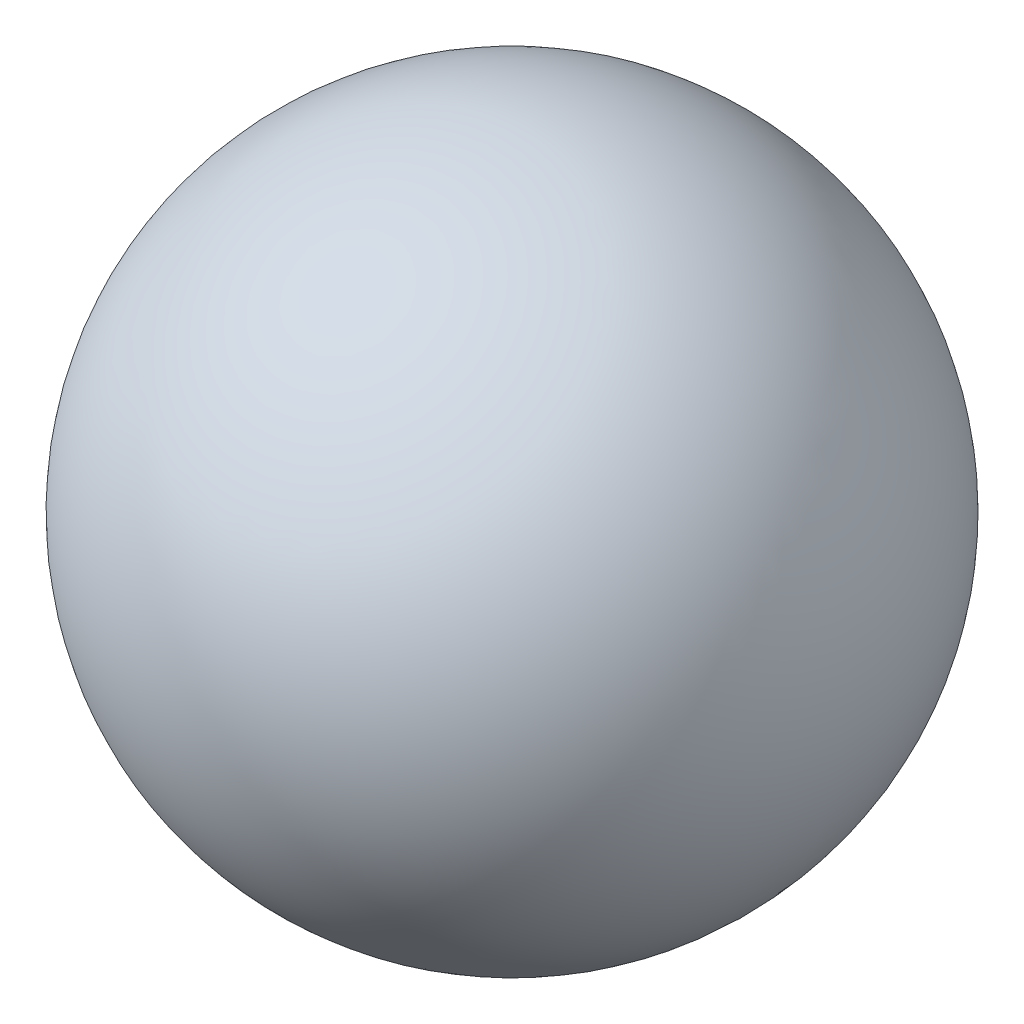
ISO-10303-21;
HEADER;
FILE_DESCRIPTION(('STEP AP214'),'2;1');
FILE_NAME('part.step','',(''),(''),'','','');
FILE_SCHEMA(('AUTOMOTIVE_DESIGN { 1 0 10303 214 1 1 1 1 }'));
ENDSEC;
DATA;
#1=APPLICATION_CONTEXT('core data for automotive mechanical design processes');
#2=APPLICATION_PROTOCOL_DEFINITION('international standard','automotive_design',2000,#1);
#3=PRODUCT_CONTEXT('',#1,'mechanical');
#4=PRODUCT('Part','Part','',(#3));
#5=PRODUCT_RELATED_PRODUCT_CATEGORY('part','',(#4));
#6=PRODUCT_DEFINITION_FORMATION('','',#4);
#7=PRODUCT_DEFINITION_CONTEXT('part definition',#1,'design');
#8=PRODUCT_DEFINITION('design','',#6,#7);
#9=PRODUCT_DEFINITION_SHAPE('','',#8);
#10=(LENGTH_UNIT() NAMED_UNIT(*) SI_UNIT(.MILLI.,.METRE.));
#11=(NAMED_UNIT(*) PLANE_ANGLE_UNIT() SI_UNIT($,.RADIAN.));
#12=(NAMED_UNIT(*) SI_UNIT($,.STERADIAN.) SOLID_ANGLE_UNIT());
#13=UNCERTAINTY_MEASURE_WITH_UNIT(LENGTH_MEASURE(1.E-05),#10,'distance_accuracy_value','');
#14=(GEOMETRIC_REPRESENTATION_CONTEXT(3) GLOBAL_UNCERTAINTY_ASSIGNED_CONTEXT((#13)) GLOBAL_UNIT_ASSIGNED_CONTEXT((#10,
#11,#12)) REPRESENTATION_CONTEXT('',''));
#15=CARTESIAN_POINT('',(0.,0.,0.));
#16=DIRECTION('',(0.,0.,1.));
#17=DIRECTION('',(1.,0.,0.));
#18=AXIS2_PLACEMENT_3D('',#15,#16,#17);
#19=CARTESIAN_POINT('',(0.,0.,0.));
#20=DIRECTION('',(0.479425538604204,0.877582561890372,0.));
#21=DIRECTION('',(0.877582561890372,-0.479425538604204,0.));
#22=AXIS2_PLACEMENT_3D('',#19,#20,#21);
#23=SPHERICAL_SURFACE('',#22,11.25);
#24=CARTESIAN_POINT('',(5.39353730929729,9.87280382126669,0.));
#25=VERTEX_POINT('',#24);
#26=VERTEX_LOOP('',#25);
#27=FACE_BOUND('',#26,.T.);
#28=CARTESIAN_POINT('',(-5.39353730929729,-9.87280382126669,0.));
#29=VERTEX_POINT('',#28);
#30=VERTEX_LOOP('',#29);
#31=FACE_BOUND('',#30,.T.);
#32=ADVANCED_FACE('F16',(#27,#31),#23,.T.);
#33=CLOSED_SHELL('',(#32));
#34=MANIFOLD_SOLID_BREP('B1',#33);
#35=ADVANCED_BREP_SHAPE_REPRESENTATION('',(#18,#34),#14);
#36=SHAPE_DEFINITION_REPRESENTATION(#9,#35);
ENDSEC;
END-ISO-10303-21;
